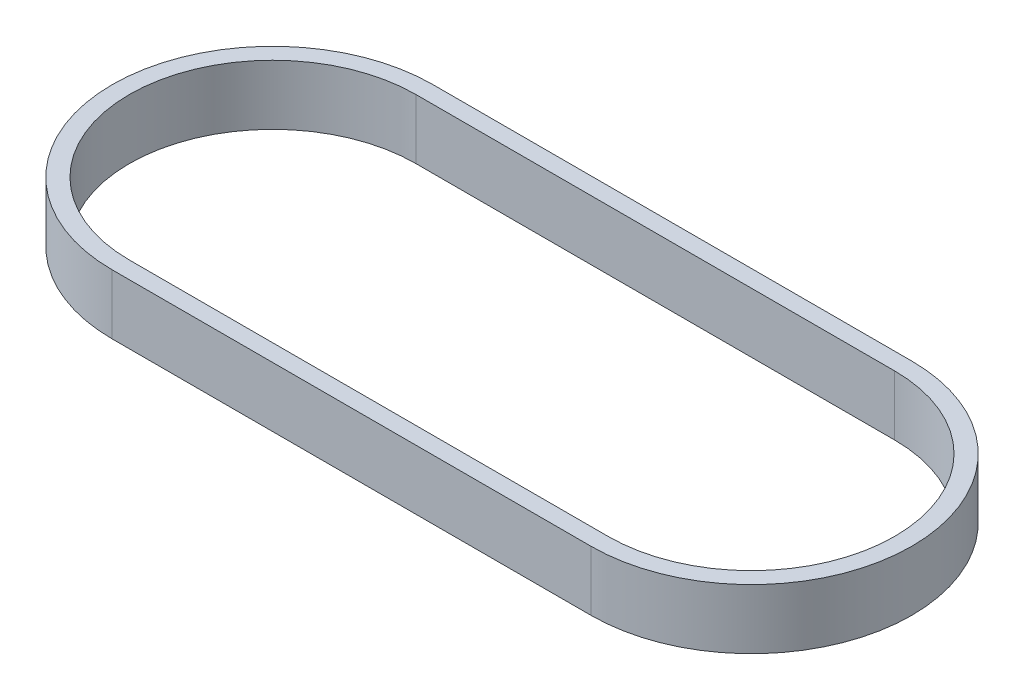
ISO-10303-21;
HEADER;
FILE_DESCRIPTION(('STEP AP214'),'2;1');
FILE_NAME('part.step','',(''),(''),'','','');
FILE_SCHEMA(('AUTOMOTIVE_DESIGN { 1 0 10303 214 1 1 1 1 }'));
ENDSEC;
DATA;
#1=APPLICATION_CONTEXT('core data for automotive mechanical design processes');
#2=APPLICATION_PROTOCOL_DEFINITION('international standard','automotive_design',2000,#1);
#3=PRODUCT_CONTEXT('',#1,'mechanical');
#4=PRODUCT('Part','Part','',(#3));
#5=PRODUCT_RELATED_PRODUCT_CATEGORY('part','',(#4));
#6=PRODUCT_DEFINITION_FORMATION('','',#4);
#7=PRODUCT_DEFINITION_CONTEXT('part definition',#1,'design');
#8=PRODUCT_DEFINITION('design','',#6,#7);
#9=PRODUCT_DEFINITION_SHAPE('','',#8);
#10=(LENGTH_UNIT() NAMED_UNIT(*) SI_UNIT(.MILLI.,.METRE.));
#11=(NAMED_UNIT(*) PLANE_ANGLE_UNIT() SI_UNIT($,.RADIAN.));
#12=(NAMED_UNIT(*) SI_UNIT($,.STERADIAN.) SOLID_ANGLE_UNIT());
#13=UNCERTAINTY_MEASURE_WITH_UNIT(LENGTH_MEASURE(1.E-05),#10,'distance_accuracy_value','');
#14=(GEOMETRIC_REPRESENTATION_CONTEXT(3) GLOBAL_UNCERTAINTY_ASSIGNED_CONTEXT((#13)) GLOBAL_UNIT_ASSIGNED_CONTEXT((#10,
#11,#12)) REPRESENTATION_CONTEXT('',''));
#15=CARTESIAN_POINT('',(0.,0.,0.));
#16=DIRECTION('',(0.,0.,1.));
#17=DIRECTION('',(1.,0.,0.));
#18=AXIS2_PLACEMENT_3D('',#15,#16,#17);
#19=CARTESIAN_POINT('',(0.,7.,0.));
#20=DIRECTION('',(0.,1.,0.));
#21=DIRECTION('',(0.,0.,1.));
#22=AXIS2_PLACEMENT_3D('',#19,#20,#21);
#23=PLANE('',#22);
#24=CARTESIAN_POINT('',(0.,7.,0.));
#25=DIRECTION('',(0.,1.,0.));
#26=DIRECTION('',(1.,0.,0.));
#27=AXIS2_PLACEMENT_3D('',#24,#25,#26);
#28=CIRCLE('',#27,18.76);
#29=CARTESIAN_POINT('',(0.,7.,-18.76));
#30=VERTEX_POINT('',#29);
#31=CARTESIAN_POINT('',(0.,7.,18.76));
#32=VERTEX_POINT('',#31);
#33=EDGE_CURVE('E158',#30,#32,#28,.T.);
#34=ORIENTED_EDGE('',*,*,#33,.T.);
#35=DIRECTION('',(1.,0.,0.));
#36=VECTOR('',#35,1.);
#37=CARTESIAN_POINT('',(0.,7.,18.76));
#38=LINE('',#37,#36);
#39=CARTESIAN_POINT('',(56.,7.,18.76));
#40=VERTEX_POINT('',#39);
#41=EDGE_CURVE('E161',#32,#40,#38,.T.);
#42=ORIENTED_EDGE('',*,*,#41,.T.);
#43=CARTESIAN_POINT('',(56.,7.,0.));
#44=DIRECTION('',(0.,1.,0.));
#45=DIRECTION('',(1.,0.,0.));
#46=AXIS2_PLACEMENT_3D('',#43,#44,#45);
#47=CIRCLE('',#46,18.76);
#48=CARTESIAN_POINT('',(56.,7.,-18.76));
#49=VERTEX_POINT('',#48);
#50=EDGE_CURVE('E164',#40,#49,#47,.T.);
#51=ORIENTED_EDGE('',*,*,#50,.T.);
#52=DIRECTION('',(-1.,0.,0.));
#53=VECTOR('',#52,1.);
#54=CARTESIAN_POINT('',(0.,7.,-18.76));
#55=LINE('',#54,#53);
#56=EDGE_CURVE('E166',#49,#30,#55,.T.);
#57=ORIENTED_EDGE('',*,*,#56,.T.);
#58=EDGE_LOOP('',(#34,#42,#51,#57));
#59=FACE_BOUND('',#58,.T.);
#60=DIRECTION('',(1.,0.,0.));
#61=VECTOR('',#60,1.);
#62=CARTESIAN_POINT('',(0.,7.,16.76));
#63=LINE('',#62,#61);
#64=CARTESIAN_POINT('',(0.,7.,16.76));
#65=VERTEX_POINT('',#64);
#66=CARTESIAN_POINT('',(56.,7.,16.76));
#67=VERTEX_POINT('',#66);
#68=EDGE_CURVE('E130',#65,#67,#63,.T.);
#69=ORIENTED_EDGE('',*,*,#68,.F.);
#70=CARTESIAN_POINT('',(0.,7.,0.));
#71=DIRECTION('',(0.,1.,0.));
#72=DIRECTION('',(1.,0.,0.));
#73=AXIS2_PLACEMENT_3D('',#70,#71,#72);
#74=CIRCLE('',#73,16.76);
#75=CARTESIAN_POINT('',(0.,7.,-16.76));
#76=VERTEX_POINT('',#75);
#77=EDGE_CURVE('E122',#76,#65,#74,.T.);
#78=ORIENTED_EDGE('',*,*,#77,.F.);
#79=DIRECTION('',(-1.,0.,0.));
#80=VECTOR('',#79,1.);
#81=CARTESIAN_POINT('',(0.,7.,-16.76));
#82=LINE('',#81,#80);
#83=CARTESIAN_POINT('',(56.,7.,-16.76));
#84=VERTEX_POINT('',#83);
#85=EDGE_CURVE('E144',#84,#76,#82,.T.);
#86=ORIENTED_EDGE('',*,*,#85,.F.);
#87=CARTESIAN_POINT('',(56.,7.,0.));
#88=DIRECTION('',(0.,1.,0.));
#89=DIRECTION('',(1.,0.,0.));
#90=AXIS2_PLACEMENT_3D('',#87,#88,#89);
#91=CIRCLE('',#90,16.76);
#92=EDGE_CURVE('E142',#67,#84,#91,.T.);
#93=ORIENTED_EDGE('',*,*,#92,.F.);
#94=EDGE_LOOP('',(#69,#78,#86,#93));
#95=FACE_BOUND('',#94,.T.);
#96=ADVANCED_FACE('F57',(#59,#95),#23,.T.);
#97=CARTESIAN_POINT('',(0.,0.,0.));
#98=DIRECTION('',(0.,1.,0.));
#99=DIRECTION('',(0.,0.,1.));
#100=AXIS2_PLACEMENT_3D('',#97,#98,#99);
#101=PLANE('',#100);
#102=CARTESIAN_POINT('',(0.,0.,0.));
#103=DIRECTION('',(0.,1.,0.));
#104=DIRECTION('',(1.,0.,0.));
#105=AXIS2_PLACEMENT_3D('',#102,#103,#104);
#106=CIRCLE('',#105,18.76);
#107=CARTESIAN_POINT('',(0.,0.,-18.76));
#108=VERTEX_POINT('',#107);
#109=CARTESIAN_POINT('',(0.,0.,18.76));
#110=VERTEX_POINT('',#109);
#111=EDGE_CURVE('E138',#108,#110,#106,.T.);
#112=ORIENTED_EDGE('',*,*,#111,.F.);
#113=DIRECTION('',(-1.,0.,0.));
#114=VECTOR('',#113,1.);
#115=CARTESIAN_POINT('',(0.,0.,-18.76));
#116=LINE('',#115,#114);
#117=CARTESIAN_POINT('',(56.,0.,-18.76));
#118=VERTEX_POINT('',#117);
#119=EDGE_CURVE('E162',#118,#108,#116,.T.);
#120=ORIENTED_EDGE('',*,*,#119,.F.);
#121=CARTESIAN_POINT('',(56.,0.,0.));
#122=DIRECTION('',(0.,1.,0.));
#123=DIRECTION('',(1.,0.,0.));
#124=AXIS2_PLACEMENT_3D('',#121,#122,#123);
#125=CIRCLE('',#124,18.76);
#126=CARTESIAN_POINT('',(56.,0.,18.76));
#127=VERTEX_POINT('',#126);
#128=EDGE_CURVE('E173',#127,#118,#125,.T.);
#129=ORIENTED_EDGE('',*,*,#128,.F.);
#130=DIRECTION('',(1.,0.,0.));
#131=VECTOR('',#130,1.);
#132=CARTESIAN_POINT('',(0.,0.,18.76));
#133=LINE('',#132,#131);
#134=EDGE_CURVE('E171',#110,#127,#133,.T.);
#135=ORIENTED_EDGE('',*,*,#134,.F.);
#136=EDGE_LOOP('',(#112,#120,#129,#135));
#137=FACE_BOUND('',#136,.T.);
#138=CARTESIAN_POINT('',(0.,0.,0.));
#139=DIRECTION('',(0.,1.,0.));
#140=DIRECTION('',(1.,0.,0.));
#141=AXIS2_PLACEMENT_3D('',#138,#139,#140);
#142=CIRCLE('',#141,16.76);
#143=CARTESIAN_POINT('',(0.,0.,-16.76));
#144=VERTEX_POINT('',#143);
#145=CARTESIAN_POINT('',(0.,0.,16.76));
#146=VERTEX_POINT('',#145);
#147=EDGE_CURVE('E80',#144,#146,#142,.T.);
#148=ORIENTED_EDGE('',*,*,#147,.T.);
#149=DIRECTION('',(1.,0.,0.));
#150=VECTOR('',#149,1.);
#151=CARTESIAN_POINT('',(0.,0.,16.76));
#152=LINE('',#151,#150);
#153=CARTESIAN_POINT('',(56.,0.,16.76));
#154=VERTEX_POINT('',#153);
#155=EDGE_CURVE('E137',#146,#154,#152,.T.);
#156=ORIENTED_EDGE('',*,*,#155,.T.);
#157=CARTESIAN_POINT('',(56.,0.,0.));
#158=DIRECTION('',(0.,1.,0.));
#159=DIRECTION('',(1.,0.,0.));
#160=AXIS2_PLACEMENT_3D('',#157,#158,#159);
#161=CIRCLE('',#160,16.76);
#162=CARTESIAN_POINT('',(56.,0.,-16.76));
#163=VERTEX_POINT('',#162);
#164=EDGE_CURVE('E150',#154,#163,#161,.T.);
#165=ORIENTED_EDGE('',*,*,#164,.T.);
#166=DIRECTION('',(-1.,0.,0.));
#167=VECTOR('',#166,1.);
#168=CARTESIAN_POINT('',(0.,0.,-16.76));
#169=LINE('',#168,#167);
#170=EDGE_CURVE('E131',#163,#144,#169,.T.);
#171=ORIENTED_EDGE('',*,*,#170,.T.);
#172=EDGE_LOOP('',(#148,#156,#165,#171));
#173=FACE_BOUND('',#172,.T.);
#174=ADVANCED_FACE('F191',(#137,#173),#101,.F.);
#175=CARTESIAN_POINT('',(0.,7.,0.));
#176=DIRECTION('',(0.,-1.,0.));
#177=DIRECTION('',(0.,0.,-1.));
#178=AXIS2_PLACEMENT_3D('',#175,#176,#177);
#179=CYLINDRICAL_SURFACE('',#178,18.76);
#180=ORIENTED_EDGE('',*,*,#111,.T.);
#181=DIRECTION('',(0.,-1.,0.));
#182=VECTOR('',#181,1.);
#183=CARTESIAN_POINT('',(0.,7.,18.76));
#184=LINE('',#183,#182);
#185=EDGE_CURVE('E12',#32,#110,#184,.T.);
#186=ORIENTED_EDGE('',*,*,#185,.F.);
#187=ORIENTED_EDGE('',*,*,#33,.F.);
#188=DIRECTION('',(0.,-1.,0.));
#189=VECTOR('',#188,1.);
#190=CARTESIAN_POINT('',(0.,7.,-18.76));
#191=LINE('',#190,#189);
#192=EDGE_CURVE('E168',#30,#108,#191,.T.);
#193=ORIENTED_EDGE('',*,*,#192,.T.);
#194=EDGE_LOOP('',(#180,#186,#187,#193));
#195=FACE_BOUND('',#194,.T.);
#196=ADVANCED_FACE('F59',(#195),#179,.T.);
#197=CARTESIAN_POINT('',(0.,7.,18.76));
#198=DIRECTION('',(0.,0.,-1.));
#199=DIRECTION('',(-1.,0.,0.));
#200=AXIS2_PLACEMENT_3D('',#197,#198,#199);
#201=PLANE('',#200);
#202=ORIENTED_EDGE('',*,*,#134,.T.);
#203=DIRECTION('',(0.,-1.,0.));
#204=VECTOR('',#203,1.);
#205=CARTESIAN_POINT('',(56.,7.,18.76));
#206=LINE('',#205,#204);
#207=EDGE_CURVE('E65',#40,#127,#206,.T.);
#208=ORIENTED_EDGE('',*,*,#207,.F.);
#209=ORIENTED_EDGE('',*,*,#41,.F.);
#210=ORIENTED_EDGE('',*,*,#185,.T.);
#211=EDGE_LOOP('',(#202,#208,#209,#210));
#212=FACE_BOUND('',#211,.T.);
#213=ADVANCED_FACE('F201',(#212),#201,.F.);
#214=CARTESIAN_POINT('',(56.,7.,0.));
#215=DIRECTION('',(0.,-1.,0.));
#216=DIRECTION('',(0.,0.,-1.));
#217=AXIS2_PLACEMENT_3D('',#214,#215,#216);
#218=CYLINDRICAL_SURFACE('',#217,18.76);
#219=ORIENTED_EDGE('',*,*,#128,.T.);
#220=DIRECTION('',(0.,-1.,0.));
#221=VECTOR('',#220,1.);
#222=CARTESIAN_POINT('',(56.,7.,-18.76));
#223=LINE('',#222,#221);
#224=EDGE_CURVE('E178',#49,#118,#223,.T.);
#225=ORIENTED_EDGE('',*,*,#224,.F.);
#226=ORIENTED_EDGE('',*,*,#50,.F.);
#227=ORIENTED_EDGE('',*,*,#207,.T.);
#228=EDGE_LOOP('',(#219,#225,#226,#227));
#229=FACE_BOUND('',#228,.T.);
#230=ADVANCED_FACE('F185',(#229),#218,.T.);
#231=CARTESIAN_POINT('',(0.,7.,-18.76));
#232=DIRECTION('',(0.,0.,1.));
#233=DIRECTION('',(1.,0.,0.));
#234=AXIS2_PLACEMENT_3D('',#231,#232,#233);
#235=PLANE('',#234);
#236=ORIENTED_EDGE('',*,*,#119,.T.);
#237=ORIENTED_EDGE('',*,*,#192,.F.);
#238=ORIENTED_EDGE('',*,*,#56,.F.);
#239=ORIENTED_EDGE('',*,*,#224,.T.);
#240=EDGE_LOOP('',(#236,#237,#238,#239));
#241=FACE_BOUND('',#240,.T.);
#242=ADVANCED_FACE('F195',(#241),#235,.F.);
#243=CARTESIAN_POINT('',(0.,7.,0.));
#244=DIRECTION('',(0.,-1.,0.));
#245=DIRECTION('',(0.,0.,-1.));
#246=AXIS2_PLACEMENT_3D('',#243,#244,#245);
#247=CYLINDRICAL_SURFACE('',#246,16.76);
#248=ORIENTED_EDGE('',*,*,#147,.F.);
#249=DIRECTION('',(0.,-1.,0.));
#250=VECTOR('',#249,1.);
#251=CARTESIAN_POINT('',(0.,7.,-16.76));
#252=LINE('',#251,#250);
#253=EDGE_CURVE('E126',#76,#144,#252,.T.);
#254=ORIENTED_EDGE('',*,*,#253,.F.);
#255=ORIENTED_EDGE('',*,*,#77,.T.);
#256=DIRECTION('',(0.,-1.,0.));
#257=VECTOR('',#256,1.);
#258=CARTESIAN_POINT('',(0.,7.,16.76));
#259=LINE('',#258,#257);
#260=EDGE_CURVE('E125',#65,#146,#259,.T.);
#261=ORIENTED_EDGE('',*,*,#260,.T.);
#262=EDGE_LOOP('',(#248,#254,#255,#261));
#263=FACE_BOUND('',#262,.T.);
#264=ADVANCED_FACE('F124',(#263),#247,.F.);
#265=CARTESIAN_POINT('',(0.,7.,16.76));
#266=DIRECTION('',(0.,0.,-1.));
#267=DIRECTION('',(-1.,0.,0.));
#268=AXIS2_PLACEMENT_3D('',#265,#266,#267);
#269=PLANE('',#268);
#270=ORIENTED_EDGE('',*,*,#155,.F.);
#271=ORIENTED_EDGE('',*,*,#260,.F.);
#272=ORIENTED_EDGE('',*,*,#68,.T.);
#273=DIRECTION('',(0.,-1.,0.));
#274=VECTOR('',#273,1.);
#275=CARTESIAN_POINT('',(56.,7.,16.76));
#276=LINE('',#275,#274);
#277=EDGE_CURVE('E139',#67,#154,#276,.T.);
#278=ORIENTED_EDGE('',*,*,#277,.T.);
#279=EDGE_LOOP('',(#270,#271,#272,#278));
#280=FACE_BOUND('',#279,.T.);
#281=ADVANCED_FACE('F134',(#280),#269,.T.);
#282=CARTESIAN_POINT('',(56.,7.,0.));
#283=DIRECTION('',(0.,-1.,0.));
#284=DIRECTION('',(0.,0.,-1.));
#285=AXIS2_PLACEMENT_3D('',#282,#283,#284);
#286=CYLINDRICAL_SURFACE('',#285,16.76);
#287=ORIENTED_EDGE('',*,*,#164,.F.);
#288=ORIENTED_EDGE('',*,*,#277,.F.);
#289=ORIENTED_EDGE('',*,*,#92,.T.);
#290=DIRECTION('',(0.,-1.,0.));
#291=VECTOR('',#290,1.);
#292=CARTESIAN_POINT('',(56.,7.,-16.76));
#293=LINE('',#292,#291);
#294=EDGE_CURVE('E72',#84,#163,#293,.T.);
#295=ORIENTED_EDGE('',*,*,#294,.T.);
#296=EDGE_LOOP('',(#287,#288,#289,#295));
#297=FACE_BOUND('',#296,.T.);
#298=ADVANCED_FACE('F224',(#297),#286,.F.);
#299=CARTESIAN_POINT('',(0.,7.,-16.76));
#300=DIRECTION('',(0.,0.,1.));
#301=DIRECTION('',(1.,0.,0.));
#302=AXIS2_PLACEMENT_3D('',#299,#300,#301);
#303=PLANE('',#302);
#304=ORIENTED_EDGE('',*,*,#170,.F.);
#305=ORIENTED_EDGE('',*,*,#294,.F.);
#306=ORIENTED_EDGE('',*,*,#85,.T.);
#307=ORIENTED_EDGE('',*,*,#253,.T.);
#308=EDGE_LOOP('',(#304,#305,#306,#307));
#309=FACE_BOUND('',#308,.T.);
#310=ADVANCED_FACE('F228',(#309),#303,.T.);
#311=CLOSED_SHELL('',(#96,#174,#196,#213,#230,#242,#264,#281,#298,#310));
#312=MANIFOLD_SOLID_BREP('B2',#311);
#313=ADVANCED_BREP_SHAPE_REPRESENTATION('',(#18,#312),#14);
#314=SHAPE_DEFINITION_REPRESENTATION(#9,#313);
ENDSEC;
END-ISO-10303-21;
